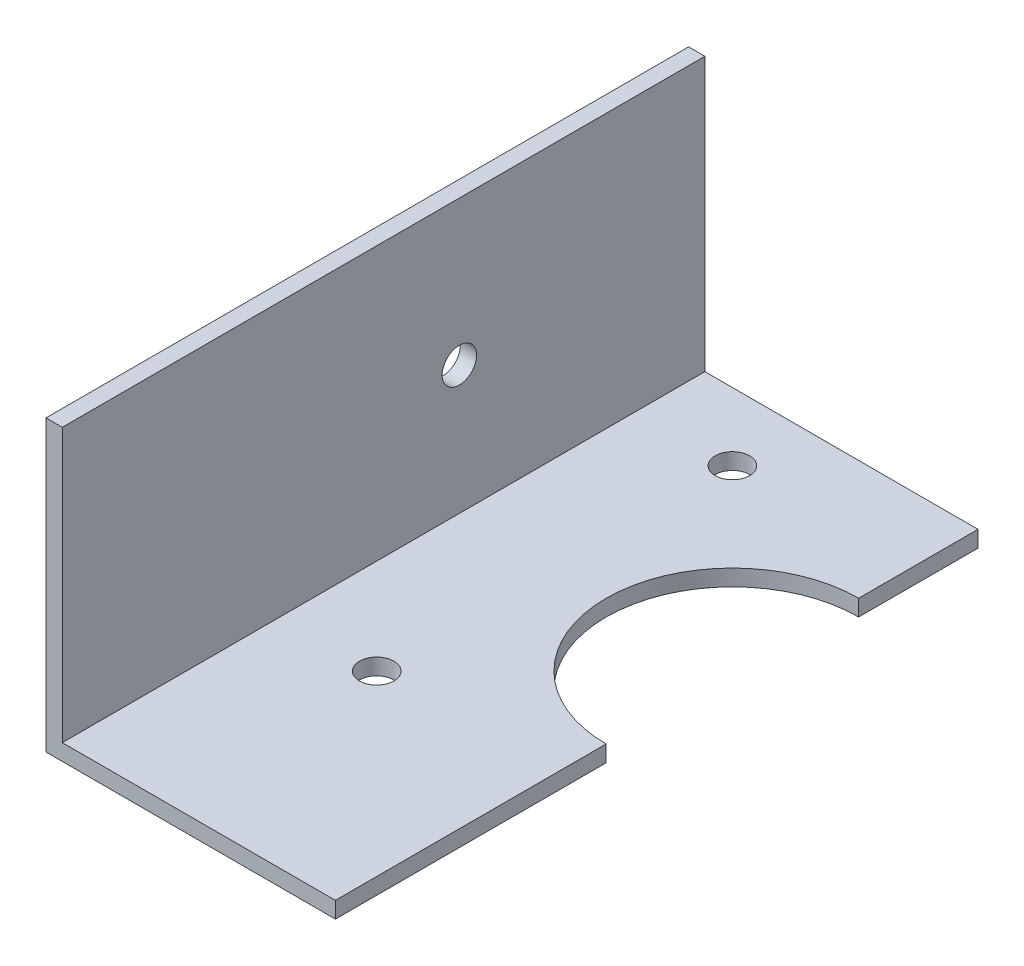
ISO-10303-21;
HEADER;
FILE_DESCRIPTION(('STEP AP214'),'2;1');
FILE_NAME('part.step','',(''),(''),'','','');
FILE_SCHEMA(('AUTOMOTIVE_DESIGN { 1 0 10303 214 1 1 1 1 }'));
ENDSEC;
DATA;
#1=APPLICATION_CONTEXT('core data for automotive mechanical design processes');
#2=APPLICATION_PROTOCOL_DEFINITION('international standard','automotive_design',2000,#1);
#3=PRODUCT_CONTEXT('',#1,'mechanical');
#4=PRODUCT('Part','Part','',(#3));
#5=PRODUCT_RELATED_PRODUCT_CATEGORY('part','',(#4));
#6=PRODUCT_DEFINITION_FORMATION('','',#4);
#7=PRODUCT_DEFINITION_CONTEXT('part definition',#1,'design');
#8=PRODUCT_DEFINITION('design','',#6,#7);
#9=PRODUCT_DEFINITION_SHAPE('','',#8);
#10=(LENGTH_UNIT() NAMED_UNIT(*) SI_UNIT(.MILLI.,.METRE.));
#11=(NAMED_UNIT(*) PLANE_ANGLE_UNIT() SI_UNIT($,.RADIAN.));
#12=(NAMED_UNIT(*) SI_UNIT($,.STERADIAN.) SOLID_ANGLE_UNIT());
#13=UNCERTAINTY_MEASURE_WITH_UNIT(LENGTH_MEASURE(1.E-05),#10,'distance_accuracy_value','');
#14=(GEOMETRIC_REPRESENTATION_CONTEXT(3) GLOBAL_UNCERTAINTY_ASSIGNED_CONTEXT((#13)) GLOBAL_UNIT_ASSIGNED_CONTEXT((#10,
#11,#12)) REPRESENTATION_CONTEXT('',''));
#15=CARTESIAN_POINT('',(0.,0.,0.));
#16=DIRECTION('',(0.,0.,1.));
#17=DIRECTION('',(1.,0.,0.));
#18=AXIS2_PLACEMENT_3D('',#15,#16,#17);
#19=CARTESIAN_POINT('',(25.22,-25.22,56.));
#20=DIRECTION('',(-1.,0.,0.));
#21=DIRECTION('',(0.,0.,1.));
#22=AXIS2_PLACEMENT_3D('',#19,#20,#21);
#23=PLANE('',#22);
#24=DIRECTION('',(0.,0.,-1.));
#25=VECTOR('',#24,1.);
#26=CARTESIAN_POINT('',(25.22,-23.8,56.));
#27=LINE('',#26,#25);
#28=CARTESIAN_POINT('',(25.22,-23.8,10.4));
#29=VERTEX_POINT('',#28);
#30=CARTESIAN_POINT('',(25.22,-23.8,0.));
#31=VERTEX_POINT('',#30);
#32=EDGE_CURVE('E167',#29,#31,#27,.T.);
#33=ORIENTED_EDGE('',*,*,#32,.F.);
#34=DIRECTION('',(0.,-1.,0.));
#35=VECTOR('',#34,1.);
#36=CARTESIAN_POINT('',(25.22,0.,10.4));
#37=LINE('',#36,#35);
#38=CARTESIAN_POINT('',(25.22,-25.22,10.4));
#39=VERTEX_POINT('',#38);
#40=EDGE_CURVE('E45',#29,#39,#37,.T.);
#41=ORIENTED_EDGE('',*,*,#40,.T.);
#42=DIRECTION('',(0.,0.,-1.));
#43=VECTOR('',#42,1.);
#44=CARTESIAN_POINT('',(25.22,-25.22,56.));
#45=LINE('',#44,#43);
#46=CARTESIAN_POINT('',(25.22,-25.22,0.));
#47=VERTEX_POINT('',#46);
#48=EDGE_CURVE('E110',#39,#47,#45,.T.);
#49=ORIENTED_EDGE('',*,*,#48,.T.);
#50=DIRECTION('',(0.,1.,0.));
#51=VECTOR('',#50,1.);
#52=CARTESIAN_POINT('',(25.22,-25.22,0.));
#53=LINE('',#52,#51);
#54=EDGE_CURVE('E149',#47,#31,#53,.T.);
#55=ORIENTED_EDGE('',*,*,#54,.T.);
#56=EDGE_LOOP('',(#33,#41,#49,#55));
#57=FACE_BOUND('',#56,.T.);
#58=ADVANCED_FACE('F29',(#57),#23,.F.);
#59=CARTESIAN_POINT('',(1.42,0.,56.));
#60=DIRECTION('',(0.,-1.,0.));
#61=DIRECTION('',(0.,0.,-1.));
#62=AXIS2_PLACEMENT_3D('',#59,#60,#61);
#63=PLANE('',#62);
#64=DIRECTION('',(-1.,0.,0.));
#65=VECTOR('',#64,1.);
#66=CARTESIAN_POINT('',(1.42,0.,0.));
#67=LINE('',#66,#65);
#68=CARTESIAN_POINT('',(1.42,0.,0.));
#69=VERTEX_POINT('',#68);
#70=CARTESIAN_POINT('',(0.,0.,0.));
#71=VERTEX_POINT('',#70);
#72=EDGE_CURVE('E135',#69,#71,#67,.T.);
#73=ORIENTED_EDGE('',*,*,#72,.T.);
#74=DIRECTION('',(0.,0.,-1.));
#75=VECTOR('',#74,1.);
#76=CARTESIAN_POINT('',(0.,0.,56.));
#77=LINE('',#76,#75);
#78=CARTESIAN_POINT('',(0.,0.,56.));
#79=VERTEX_POINT('',#78);
#80=EDGE_CURVE('E38',#79,#71,#77,.T.);
#81=ORIENTED_EDGE('',*,*,#80,.F.);
#82=DIRECTION('',(-1.,0.,0.));
#83=VECTOR('',#82,1.);
#84=CARTESIAN_POINT('',(1.42,0.,56.));
#85=LINE('',#84,#83);
#86=CARTESIAN_POINT('',(1.42,0.,56.));
#87=VERTEX_POINT('',#86);
#88=EDGE_CURVE('E156',#87,#79,#85,.T.);
#89=ORIENTED_EDGE('',*,*,#88,.F.);
#90=DIRECTION('',(0.,0.,-1.));
#91=VECTOR('',#90,1.);
#92=CARTESIAN_POINT('',(1.42,0.,56.));
#93=LINE('',#92,#91);
#94=EDGE_CURVE('E136',#87,#69,#93,.T.);
#95=ORIENTED_EDGE('',*,*,#94,.T.);
#96=EDGE_LOOP('',(#73,#81,#89,#95));
#97=FACE_BOUND('',#96,.T.);
#98=ADVANCED_FACE('F31',(#97),#63,.F.);
#99=CARTESIAN_POINT('',(0.,0.,56.));
#100=DIRECTION('',(1.,0.,0.));
#101=DIRECTION('',(0.,0.,-1.));
#102=AXIS2_PLACEMENT_3D('',#99,#100,#101);
#103=PLANE('',#102);
#104=CARTESIAN_POINT('',(0.,-12.61,21.4));
#105=DIRECTION('',(-1.,0.,0.));
#106=DIRECTION('',(0.,0.,1.));
#107=AXIS2_PLACEMENT_3D('',#104,#105,#106);
#108=CIRCLE('',#107,1.5);
#109=CARTESIAN_POINT('',(0.,-12.61,22.9));
#110=VERTEX_POINT('',#109);
#111=EDGE_CURVE('E144',#110,#110,#108,.T.);
#112=ORIENTED_EDGE('',*,*,#111,.F.);
#113=EDGE_LOOP('',(#112));
#114=FACE_BOUND('',#113,.T.);
#115=DIRECTION('',(0.,-1.,0.));
#116=VECTOR('',#115,1.);
#117=CARTESIAN_POINT('',(0.,0.,0.));
#118=LINE('',#117,#116);
#119=CARTESIAN_POINT('',(0.,-25.22,0.));
#120=VERTEX_POINT('',#119);
#121=EDGE_CURVE('E129',#71,#120,#118,.T.);
#122=ORIENTED_EDGE('',*,*,#121,.T.);
#123=DIRECTION('',(0.,0.,-1.));
#124=VECTOR('',#123,1.);
#125=CARTESIAN_POINT('',(0.,-25.22,56.));
#126=LINE('',#125,#124);
#127=CARTESIAN_POINT('',(0.,-25.22,56.));
#128=VERTEX_POINT('',#127);
#129=EDGE_CURVE('E115',#128,#120,#126,.T.);
#130=ORIENTED_EDGE('',*,*,#129,.F.);
#131=DIRECTION('',(0.,-1.,0.));
#132=VECTOR('',#131,1.);
#133=CARTESIAN_POINT('',(0.,0.,56.));
#134=LINE('',#133,#132);
#135=EDGE_CURVE('E130',#79,#128,#134,.T.);
#136=ORIENTED_EDGE('',*,*,#135,.F.);
#137=ORIENTED_EDGE('',*,*,#80,.T.);
#138=EDGE_LOOP('',(#122,#130,#136,#137));
#139=FACE_BOUND('',#138,.T.);
#140=ADVANCED_FACE('F127',(#114,#139),#103,.F.);
#141=CARTESIAN_POINT('',(25.22,-25.22,56.));
#142=DIRECTION('',(0.,1.,0.));
#143=DIRECTION('',(-1.,0.,0.));
#144=AXIS2_PLACEMENT_3D('',#141,#142,#143);
#145=PLANE('',#144);
#146=CARTESIAN_POINT('',(9.72,-25.22,5.9));
#147=DIRECTION('',(0.,-1.,0.));
#148=DIRECTION('',(1.,0.,0.));
#149=AXIS2_PLACEMENT_3D('',#146,#147,#148);
#150=CIRCLE('',#149,1.5);
#151=CARTESIAN_POINT('',(11.22,-25.22,5.9));
#152=VERTEX_POINT('',#151);
#153=EDGE_CURVE('E188',#152,#152,#150,.T.);
#154=ORIENTED_EDGE('',*,*,#153,.F.);
#155=EDGE_LOOP('',(#154));
#156=FACE_BOUND('',#155,.T.);
#157=CARTESIAN_POINT('',(9.72,-25.22,36.9));
#158=DIRECTION('',(0.,-1.,0.));
#159=DIRECTION('',(1.,0.,0.));
#160=AXIS2_PLACEMENT_3D('',#157,#158,#159);
#161=CIRCLE('',#160,1.5);
#162=CARTESIAN_POINT('',(11.22,-25.22,36.9));
#163=VERTEX_POINT('',#162);
#164=EDGE_CURVE('E185',#163,#163,#161,.T.);
#165=ORIENTED_EDGE('',*,*,#164,.F.);
#166=EDGE_LOOP('',(#165));
#167=FACE_BOUND('',#166,.T.);
#168=ORIENTED_EDGE('',*,*,#48,.F.);
#169=CARTESIAN_POINT('',(25.22,-25.22,21.4));
#170=DIRECTION('',(0.,-1.,0.));
#171=DIRECTION('',(1.,0.,0.));
#172=AXIS2_PLACEMENT_3D('',#169,#170,#171);
#173=CIRCLE('',#172,11.);
#174=CARTESIAN_POINT('',(25.22,-25.22,32.4));
#175=VERTEX_POINT('',#174);
#176=EDGE_CURVE('E96',#175,#39,#173,.T.);
#177=ORIENTED_EDGE('',*,*,#176,.F.);
#178=CARTESIAN_POINT('',(25.22,-25.22,56.));
#179=VERTEX_POINT('',#178);
#180=EDGE_CURVE('E107',#179,#175,#45,.T.);
#181=ORIENTED_EDGE('',*,*,#180,.F.);
#182=DIRECTION('',(1.,0.,0.));
#183=VECTOR('',#182,1.);
#184=CARTESIAN_POINT('',(25.22,-25.22,56.));
#185=LINE('',#184,#183);
#186=EDGE_CURVE('E159',#128,#179,#185,.T.);
#187=ORIENTED_EDGE('',*,*,#186,.F.);
#188=ORIENTED_EDGE('',*,*,#129,.T.);
#189=DIRECTION('',(1.,0.,0.));
#190=VECTOR('',#189,1.);
#191=CARTESIAN_POINT('',(25.22,-25.22,0.));
#192=LINE('',#191,#190);
#193=EDGE_CURVE('E141',#120,#47,#192,.T.);
#194=ORIENTED_EDGE('',*,*,#193,.T.);
#195=EDGE_LOOP('',(#168,#177,#181,#187,#188,#194));
#196=FACE_BOUND('',#195,.T.);
#197=ADVANCED_FACE('F105',(#156,#167,#196),#145,.F.);
#198=ORIENTED_EDGE('',*,*,#180,.T.);
#199=DIRECTION('',(0.,-1.,0.));
#200=VECTOR('',#199,1.);
#201=CARTESIAN_POINT('',(25.22,0.,32.4));
#202=LINE('',#201,#200);
#203=CARTESIAN_POINT('',(25.22,-23.8,32.4));
#204=VERTEX_POINT('',#203);
#205=EDGE_CURVE('E93',#175,#204,#202,.F.);
#206=ORIENTED_EDGE('',*,*,#205,.T.);
#207=CARTESIAN_POINT('',(25.22,-23.8,56.));
#208=VERTEX_POINT('',#207);
#209=EDGE_CURVE('E119',#208,#204,#27,.T.);
#210=ORIENTED_EDGE('',*,*,#209,.F.);
#211=DIRECTION('',(0.,1.,0.));
#212=VECTOR('',#211,1.);
#213=CARTESIAN_POINT('',(25.22,-25.22,56.));
#214=LINE('',#213,#212);
#215=EDGE_CURVE('E114',#179,#208,#214,.T.);
#216=ORIENTED_EDGE('',*,*,#215,.F.);
#217=EDGE_LOOP('',(#198,#206,#210,#216));
#218=FACE_BOUND('',#217,.T.);
#219=ADVANCED_FACE('F113',(#218),#23,.F.);
#220=CARTESIAN_POINT('',(25.22,-23.8,56.));
#221=DIRECTION('',(0.,-1.,0.));
#222=DIRECTION('',(1.,0.,0.));
#223=AXIS2_PLACEMENT_3D('',#220,#221,#222);
#224=PLANE('',#223);
#225=CARTESIAN_POINT('',(9.72,-23.8,5.9));
#226=DIRECTION('',(0.,-1.,0.));
#227=DIRECTION('',(1.,0.,0.));
#228=AXIS2_PLACEMENT_3D('',#225,#226,#227);
#229=CIRCLE('',#228,1.5);
#230=CARTESIAN_POINT('',(11.22,-23.8,5.9));
#231=VERTEX_POINT('',#230);
#232=EDGE_CURVE('E33',#231,#231,#229,.T.);
#233=ORIENTED_EDGE('',*,*,#232,.T.);
#234=EDGE_LOOP('',(#233));
#235=FACE_BOUND('',#234,.T.);
#236=CARTESIAN_POINT('',(9.72,-23.8,36.9));
#237=DIRECTION('',(0.,-1.,0.));
#238=DIRECTION('',(1.,0.,0.));
#239=AXIS2_PLACEMENT_3D('',#236,#237,#238);
#240=CIRCLE('',#239,1.5);
#241=CARTESIAN_POINT('',(11.22,-23.8,36.9));
#242=VERTEX_POINT('',#241);
#243=EDGE_CURVE('E111',#242,#242,#240,.T.);
#244=ORIENTED_EDGE('',*,*,#243,.T.);
#245=EDGE_LOOP('',(#244));
#246=FACE_BOUND('',#245,.T.);
#247=ORIENTED_EDGE('',*,*,#209,.T.);
#248=CARTESIAN_POINT('',(25.22,-23.8,21.4));
#249=DIRECTION('',(0.,-1.,0.));
#250=DIRECTION('',(1.,0.,0.));
#251=AXIS2_PLACEMENT_3D('',#248,#249,#250);
#252=CIRCLE('',#251,11.);
#253=EDGE_CURVE('E11',#204,#29,#252,.T.);
#254=ORIENTED_EDGE('',*,*,#253,.T.);
#255=ORIENTED_EDGE('',*,*,#32,.T.);
#256=DIRECTION('',(-1.,0.,0.));
#257=VECTOR('',#256,1.);
#258=CARTESIAN_POINT('',(25.22,-23.8,0.));
#259=LINE('',#258,#257);
#260=CARTESIAN_POINT('',(1.42,-23.8,0.));
#261=VERTEX_POINT('',#260);
#262=EDGE_CURVE('E152',#31,#261,#259,.T.);
#263=ORIENTED_EDGE('',*,*,#262,.T.);
#264=DIRECTION('',(0.,0.,-1.));
#265=VECTOR('',#264,1.);
#266=CARTESIAN_POINT('',(1.42,-23.8,56.));
#267=LINE('',#266,#265);
#268=CARTESIAN_POINT('',(1.42,-23.8,56.));
#269=VERTEX_POINT('',#268);
#270=EDGE_CURVE('E165',#269,#261,#267,.T.);
#271=ORIENTED_EDGE('',*,*,#270,.F.);
#272=DIRECTION('',(-1.,0.,0.));
#273=VECTOR('',#272,1.);
#274=CARTESIAN_POINT('',(25.22,-23.8,56.));
#275=LINE('',#274,#273);
#276=EDGE_CURVE('E162',#208,#269,#275,.T.);
#277=ORIENTED_EDGE('',*,*,#276,.F.);
#278=EDGE_LOOP('',(#247,#254,#255,#263,#271,#277));
#279=FACE_BOUND('',#278,.T.);
#280=ADVANCED_FACE('F173',(#235,#246,#279),#224,.F.);
#281=CARTESIAN_POINT('',(1.42,0.,56.));
#282=DIRECTION('',(-1.,0.,0.));
#283=DIRECTION('',(0.,-1.,0.));
#284=AXIS2_PLACEMENT_3D('',#281,#282,#283);
#285=PLANE('',#284);
#286=CARTESIAN_POINT('',(1.42,-12.61,21.4));
#287=DIRECTION('',(-1.,0.,0.));
#288=DIRECTION('',(0.,-1.,0.));
#289=AXIS2_PLACEMENT_3D('',#286,#287,#288);
#290=CIRCLE('',#289,1.5);
#291=CARTESIAN_POINT('',(1.42,-14.11,21.4));
#292=VERTEX_POINT('',#291);
#293=EDGE_CURVE('E139',#292,#292,#290,.T.);
#294=ORIENTED_EDGE('',*,*,#293,.T.);
#295=EDGE_LOOP('',(#294));
#296=FACE_BOUND('',#295,.T.);
#297=DIRECTION('',(0.,1.,0.));
#298=VECTOR('',#297,1.);
#299=CARTESIAN_POINT('',(1.42,0.,0.));
#300=LINE('',#299,#298);
#301=EDGE_CURVE('E154',#261,#69,#300,.T.);
#302=ORIENTED_EDGE('',*,*,#301,.T.);
#303=ORIENTED_EDGE('',*,*,#94,.F.);
#304=DIRECTION('',(0.,1.,0.));
#305=VECTOR('',#304,1.);
#306=CARTESIAN_POINT('',(1.42,0.,56.));
#307=LINE('',#306,#305);
#308=EDGE_CURVE('E52',#269,#87,#307,.T.);
#309=ORIENTED_EDGE('',*,*,#308,.F.);
#310=ORIENTED_EDGE('',*,*,#270,.T.);
#311=EDGE_LOOP('',(#302,#303,#309,#310));
#312=FACE_BOUND('',#311,.T.);
#313=ADVANCED_FACE('F218',(#296,#312),#285,.F.);
#314=CARTESIAN_POINT('',(0.,0.,56.));
#315=DIRECTION('',(0.,0.,1.));
#316=DIRECTION('',(1.,0.,0.));
#317=AXIS2_PLACEMENT_3D('',#314,#315,#316);
#318=PLANE('',#317);
#319=ORIENTED_EDGE('',*,*,#88,.T.);
#320=ORIENTED_EDGE('',*,*,#135,.T.);
#321=ORIENTED_EDGE('',*,*,#186,.T.);
#322=ORIENTED_EDGE('',*,*,#215,.T.);
#323=ORIENTED_EDGE('',*,*,#276,.T.);
#324=ORIENTED_EDGE('',*,*,#308,.T.);
#325=EDGE_LOOP('',(#319,#320,#321,#322,#323,#324));
#326=FACE_BOUND('',#325,.T.);
#327=ADVANCED_FACE('F174',(#326),#318,.T.);
#328=CARTESIAN_POINT('',(0.,0.,0.));
#329=DIRECTION('',(0.,0.,1.));
#330=DIRECTION('',(1.,0.,0.));
#331=AXIS2_PLACEMENT_3D('',#328,#329,#330);
#332=PLANE('',#331);
#333=ORIENTED_EDGE('',*,*,#72,.F.);
#334=ORIENTED_EDGE('',*,*,#301,.F.);
#335=ORIENTED_EDGE('',*,*,#262,.F.);
#336=ORIENTED_EDGE('',*,*,#54,.F.);
#337=ORIENTED_EDGE('',*,*,#193,.F.);
#338=ORIENTED_EDGE('',*,*,#121,.F.);
#339=EDGE_LOOP('',(#333,#334,#335,#336,#337,#338));
#340=FACE_BOUND('',#339,.T.);
#341=ADVANCED_FACE('F177',(#340),#332,.F.);
#342=CARTESIAN_POINT('',(25.22,-12.61,21.4));
#343=DIRECTION('',(-1.,0.,0.));
#344=DIRECTION('',(0.,0.,1.));
#345=AXIS2_PLACEMENT_3D('',#342,#343,#344);
#346=CYLINDRICAL_SURFACE('',#345,1.5);
#347=ORIENTED_EDGE('',*,*,#111,.T.);
#348=EDGE_LOOP('',(#347));
#349=FACE_BOUND('',#348,.T.);
#350=ORIENTED_EDGE('',*,*,#293,.F.);
#351=EDGE_LOOP('',(#350));
#352=FACE_BOUND('',#351,.T.);
#353=ADVANCED_FACE('F232',(#349,#352),#346,.F.);
#354=CARTESIAN_POINT('',(25.22,0.,21.4));
#355=DIRECTION('',(0.,-1.,0.));
#356=DIRECTION('',(1.,0.,0.));
#357=AXIS2_PLACEMENT_3D('',#354,#355,#356);
#358=CYLINDRICAL_SURFACE('',#357,11.);
#359=ORIENTED_EDGE('',*,*,#253,.F.);
#360=ORIENTED_EDGE('',*,*,#205,.F.);
#361=ORIENTED_EDGE('',*,*,#176,.T.);
#362=ORIENTED_EDGE('',*,*,#40,.F.);
#363=EDGE_LOOP('',(#359,#360,#361,#362));
#364=FACE_BOUND('',#363,.T.);
#365=ADVANCED_FACE('F95',(#364),#358,.F.);
#366=CARTESIAN_POINT('',(9.72,0.,36.9));
#367=DIRECTION('',(0.,-1.,0.));
#368=DIRECTION('',(1.,0.,0.));
#369=AXIS2_PLACEMENT_3D('',#366,#367,#368);
#370=CYLINDRICAL_SURFACE('',#369,1.5);
#371=ORIENTED_EDGE('',*,*,#164,.T.);
#372=EDGE_LOOP('',(#371));
#373=FACE_BOUND('',#372,.T.);
#374=ORIENTED_EDGE('',*,*,#243,.F.);
#375=EDGE_LOOP('',(#374));
#376=FACE_BOUND('',#375,.T.);
#377=ADVANCED_FACE('F199',(#373,#376),#370,.F.);
#378=CARTESIAN_POINT('',(9.72,0.,5.9));
#379=DIRECTION('',(0.,-1.,0.));
#380=DIRECTION('',(1.,0.,0.));
#381=AXIS2_PLACEMENT_3D('',#378,#379,#380);
#382=CYLINDRICAL_SURFACE('',#381,1.5);
#383=ORIENTED_EDGE('',*,*,#153,.T.);
#384=EDGE_LOOP('',(#383));
#385=FACE_BOUND('',#384,.T.);
#386=ORIENTED_EDGE('',*,*,#232,.F.);
#387=EDGE_LOOP('',(#386));
#388=FACE_BOUND('',#387,.T.);
#389=ADVANCED_FACE('F197',(#385,#388),#382,.F.);
#390=CLOSED_SHELL('',(#58,#98,#140,#197,#219,#280,#313,#327,#341,#353,#365,#377,#389));
#391=MANIFOLD_SOLID_BREP('B2',#390);
#392=ADVANCED_BREP_SHAPE_REPRESENTATION('',(#18,#391),#14);
#393=SHAPE_DEFINITION_REPRESENTATION(#9,#392);
ENDSEC;
END-ISO-10303-21;
